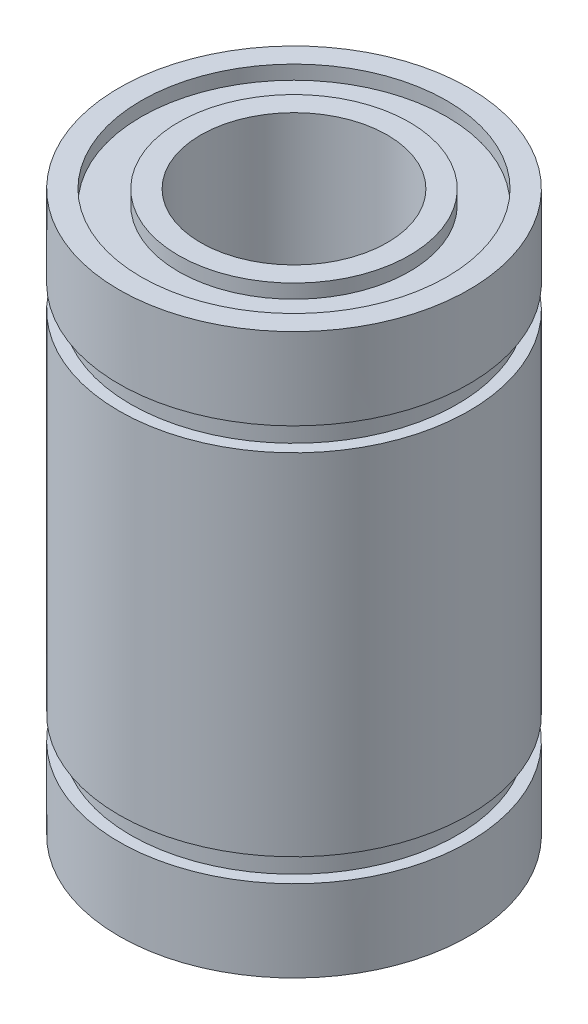
ISO-10303-21;
HEADER;
FILE_DESCRIPTION(('STEP AP214'),'2;1');
FILE_NAME('part.step','',(''),(''),'','','');
FILE_SCHEMA(('AUTOMOTIVE_DESIGN { 1 0 10303 214 1 1 1 1 }'));
ENDSEC;
DATA;
#1=APPLICATION_CONTEXT('core data for automotive mechanical design processes');
#2=APPLICATION_PROTOCOL_DEFINITION('international standard','automotive_design',2000,#1);
#3=PRODUCT_CONTEXT('',#1,'mechanical');
#4=PRODUCT('Part','Part','',(#3));
#5=PRODUCT_RELATED_PRODUCT_CATEGORY('part','',(#4));
#6=PRODUCT_DEFINITION_FORMATION('','',#4);
#7=PRODUCT_DEFINITION_CONTEXT('part definition',#1,'design');
#8=PRODUCT_DEFINITION('design','',#6,#7);
#9=PRODUCT_DEFINITION_SHAPE('','',#8);
#10=(LENGTH_UNIT() NAMED_UNIT(*) SI_UNIT(.MILLI.,.METRE.));
#11=(NAMED_UNIT(*) PLANE_ANGLE_UNIT() SI_UNIT($,.RADIAN.));
#12=(NAMED_UNIT(*) SI_UNIT($,.STERADIAN.) SOLID_ANGLE_UNIT());
#13=UNCERTAINTY_MEASURE_WITH_UNIT(LENGTH_MEASURE(1.E-05),#10,'distance_accuracy_value','');
#14=(GEOMETRIC_REPRESENTATION_CONTEXT(3) GLOBAL_UNCERTAINTY_ASSIGNED_CONTEXT((#13)) GLOBAL_UNIT_ASSIGNED_CONTEXT((#10,
#11,#12)) REPRESENTATION_CONTEXT('',''));
#15=CARTESIAN_POINT('',(0.,0.,0.));
#16=DIRECTION('',(0.,0.,1.));
#17=DIRECTION('',(1.,0.,0.));
#18=AXIS2_PLACEMENT_3D('',#15,#16,#17);
#19=CARTESIAN_POINT('',(0.,0.,0.));
#20=DIRECTION('',(0.,1.,0.));
#21=DIRECTION('',(0.,0.,1.));
#22=AXIS2_PLACEMENT_3D('',#19,#20,#21);
#23=PLANE('',#22);
#24=CARTESIAN_POINT('',(0.,0.,0.));
#25=DIRECTION('',(0.,1.,0.));
#26=DIRECTION('',(0.,0.,1.));
#27=AXIS2_PLACEMENT_3D('',#24,#25,#26);
#28=CIRCLE('',#27,4.);
#29=CARTESIAN_POINT('',(0.,0.,4.));
#30=VERTEX_POINT('',#29);
#31=EDGE_CURVE('E40',#30,#30,#28,.T.);
#32=ORIENTED_EDGE('',*,*,#31,.T.);
#33=EDGE_LOOP('',(#32));
#34=FACE_BOUND('',#33,.T.);
#35=CARTESIAN_POINT('',(0.,0.,0.));
#36=DIRECTION('',(0.,1.,0.));
#37=DIRECTION('',(0.,0.,1.));
#38=AXIS2_PLACEMENT_3D('',#35,#36,#37);
#39=CIRCLE('',#38,4.95);
#40=CARTESIAN_POINT('',(0.,0.,4.95));
#41=VERTEX_POINT('',#40);
#42=EDGE_CURVE('E36',#41,#41,#39,.T.);
#43=ORIENTED_EDGE('',*,*,#42,.F.);
#44=EDGE_LOOP('',(#43));
#45=FACE_BOUND('',#44,.T.);
#46=ADVANCED_FACE('F32',(#34,#45),#23,.F.);
#47=CARTESIAN_POINT('',(0.,0.,0.));
#48=DIRECTION('',(0.,1.,0.));
#49=DIRECTION('',(0.,0.,1.));
#50=AXIS2_PLACEMENT_3D('',#47,#48,#49);
#51=CIRCLE('',#50,7.5);
#52=CARTESIAN_POINT('',(0.,0.,7.5));
#53=VERTEX_POINT('',#52);
#54=EDGE_CURVE('E10',#53,#53,#51,.T.);
#55=ORIENTED_EDGE('',*,*,#54,.F.);
#56=EDGE_LOOP('',(#55));
#57=FACE_BOUND('',#56,.T.);
#58=CARTESIAN_POINT('',(0.,0.,0.));
#59=DIRECTION('',(0.,1.,0.));
#60=DIRECTION('',(0.,0.,1.));
#61=AXIS2_PLACEMENT_3D('',#58,#59,#60);
#62=CIRCLE('',#61,6.55);
#63=CARTESIAN_POINT('',(0.,0.,6.55));
#64=VERTEX_POINT('',#63);
#65=EDGE_CURVE('E54',#64,#64,#62,.F.);
#66=ORIENTED_EDGE('',*,*,#65,.F.);
#67=EDGE_LOOP('',(#66));
#68=FACE_BOUND('',#67,.T.);
#69=ADVANCED_FACE('F100',(#57,#68),#23,.F.);
#70=CARTESIAN_POINT('',(0.,12.,0.));
#71=DIRECTION('',(0.,-1.,0.));
#72=DIRECTION('',(0.,0.,-1.));
#73=AXIS2_PLACEMENT_3D('',#70,#71,#72);
#74=CYLINDRICAL_SURFACE('',#73,7.5);
#75=CARTESIAN_POINT('',(0.,4.5,0.));
#76=DIRECTION('',(0.,1.,0.));
#77=DIRECTION('',(0.,0.,1.));
#78=AXIS2_PLACEMENT_3D('',#75,#76,#77);
#79=CIRCLE('',#78,7.5);
#80=CARTESIAN_POINT('',(0.,4.5,7.5));
#81=VERTEX_POINT('',#80);
#82=EDGE_CURVE('E45',#81,#81,#79,.T.);
#83=ORIENTED_EDGE('',*,*,#82,.T.);
#84=EDGE_LOOP('',(#83));
#85=FACE_BOUND('',#84,.T.);
#86=CARTESIAN_POINT('',(0.,19.5,0.));
#87=DIRECTION('',(0.,1.,0.));
#88=DIRECTION('',(0.,0.,1.));
#89=AXIS2_PLACEMENT_3D('',#86,#87,#88);
#90=CIRCLE('',#89,7.5);
#91=CARTESIAN_POINT('',(0.,19.5,7.5));
#92=VERTEX_POINT('',#91);
#93=EDGE_CURVE('E172',#92,#92,#90,.T.);
#94=ORIENTED_EDGE('',*,*,#93,.F.);
#95=EDGE_LOOP('',(#94));
#96=FACE_BOUND('',#95,.T.);
#97=ADVANCED_FACE('F93',(#85,#96),#74,.T.);
#98=CARTESIAN_POINT('',(0.,3.5,0.));
#99=DIRECTION('',(0.,-1.,0.));
#100=DIRECTION('',(0.,0.,-1.));
#101=AXIS2_PLACEMENT_3D('',#98,#99,#100);
#102=CIRCLE('',#101,7.5);
#103=CARTESIAN_POINT('',(0.,3.5,-7.5));
#104=VERTEX_POINT('',#103);
#105=EDGE_CURVE('E49',#104,#104,#102,.T.);
#106=ORIENTED_EDGE('',*,*,#105,.T.);
#107=EDGE_LOOP('',(#106));
#108=FACE_BOUND('',#107,.T.);
#109=ORIENTED_EDGE('',*,*,#54,.T.);
#110=EDGE_LOOP('',(#109));
#111=FACE_BOUND('',#110,.T.);
#112=ADVANCED_FACE('F34',(#108,#111),#74,.T.);
#113=CARTESIAN_POINT('',(0.,12.,0.));
#114=DIRECTION('',(0.,-1.,0.));
#115=DIRECTION('',(0.,0.,-1.));
#116=AXIS2_PLACEMENT_3D('',#113,#114,#115);
#117=CYLINDRICAL_SURFACE('',#116,4.);
#118=ORIENTED_EDGE('',*,*,#31,.F.);
#119=EDGE_LOOP('',(#118));
#120=FACE_BOUND('',#119,.T.);
#121=CARTESIAN_POINT('',(0.,24.,0.));
#122=DIRECTION('',(0.,1.,0.));
#123=DIRECTION('',(0.,0.,1.));
#124=AXIS2_PLACEMENT_3D('',#121,#122,#123);
#125=CIRCLE('',#124,4.);
#126=CARTESIAN_POINT('',(0.,24.,4.));
#127=VERTEX_POINT('',#126);
#128=EDGE_CURVE('E175',#127,#127,#125,.T.);
#129=ORIENTED_EDGE('',*,*,#128,.T.);
#130=EDGE_LOOP('',(#129));
#131=FACE_BOUND('',#130,.T.);
#132=ADVANCED_FACE('F92',(#120,#131),#117,.F.);
#133=CARTESIAN_POINT('',(-8.,4.5,0.));
#134=DIRECTION('',(0.,1.,0.));
#135=DIRECTION('',(0.,0.,1.));
#136=AXIS2_PLACEMENT_3D('',#133,#134,#135);
#137=PLANE('',#136);
#138=CARTESIAN_POINT('',(0.,4.5,0.));
#139=DIRECTION('',(0.,1.,0.));
#140=DIRECTION('',(0.,0.,1.));
#141=AXIS2_PLACEMENT_3D('',#138,#139,#140);
#142=CIRCLE('',#141,7.);
#143=CARTESIAN_POINT('',(0.,4.5,7.));
#144=VERTEX_POINT('',#143);
#145=EDGE_CURVE('E52',#144,#144,#142,.T.);
#146=ORIENTED_EDGE('',*,*,#145,.T.);
#147=EDGE_LOOP('',(#146));
#148=FACE_BOUND('',#147,.T.);
#149=ORIENTED_EDGE('',*,*,#82,.F.);
#150=EDGE_LOOP('',(#149));
#151=FACE_BOUND('',#150,.T.);
#152=ADVANCED_FACE('F75',(#148,#151),#137,.F.);
#153=CARTESIAN_POINT('',(-8.,3.5,0.));
#154=DIRECTION('',(0.,-1.,0.));
#155=DIRECTION('',(0.,0.,-1.));
#156=AXIS2_PLACEMENT_3D('',#153,#154,#155);
#157=PLANE('',#156);
#158=CARTESIAN_POINT('',(0.,3.5,0.));
#159=DIRECTION('',(0.,1.,0.));
#160=DIRECTION('',(0.,0.,1.));
#161=AXIS2_PLACEMENT_3D('',#158,#159,#160);
#162=CIRCLE('',#161,7.);
#163=CARTESIAN_POINT('',(0.,3.5,7.));
#164=VERTEX_POINT('',#163);
#165=EDGE_CURVE('E60',#164,#164,#162,.T.);
#166=ORIENTED_EDGE('',*,*,#165,.F.);
#167=EDGE_LOOP('',(#166));
#168=FACE_BOUND('',#167,.T.);
#169=ORIENTED_EDGE('',*,*,#105,.F.);
#170=EDGE_LOOP('',(#169));
#171=FACE_BOUND('',#170,.T.);
#172=ADVANCED_FACE('F82',(#168,#171),#157,.F.);
#173=CARTESIAN_POINT('',(0.,4.,0.));
#174=DIRECTION('',(0.,1.,0.));
#175=DIRECTION('',(0.,0.,1.));
#176=AXIS2_PLACEMENT_3D('',#173,#174,#175);
#177=CYLINDRICAL_SURFACE('',#176,7.);
#178=ORIENTED_EDGE('',*,*,#145,.F.);
#179=EDGE_LOOP('',(#178));
#180=FACE_BOUND('',#179,.T.);
#181=ORIENTED_EDGE('',*,*,#165,.T.);
#182=EDGE_LOOP('',(#181));
#183=FACE_BOUND('',#182,.T.);
#184=ADVANCED_FACE('F78',(#180,#183),#177,.T.);
#185=CARTESIAN_POINT('',(0.,0.,0.));
#186=DIRECTION('',(0.,1.,0.));
#187=DIRECTION('',(0.,0.,1.));
#188=AXIS2_PLACEMENT_3D('',#185,#186,#187);
#189=CYLINDRICAL_SURFACE('',#188,4.95);
#190=CARTESIAN_POINT('',(0.,0.599999999999999,0.));
#191=DIRECTION('',(0.,1.,0.));
#192=DIRECTION('',(0.,0.,1.));
#193=AXIS2_PLACEMENT_3D('',#190,#191,#192);
#194=CIRCLE('',#193,4.95);
#195=CARTESIAN_POINT('',(0.,0.599999999999999,4.95));
#196=VERTEX_POINT('',#195);
#197=EDGE_CURVE('E56',#196,#196,#194,.T.);
#198=ORIENTED_EDGE('',*,*,#197,.F.);
#199=EDGE_LOOP('',(#198));
#200=FACE_BOUND('',#199,.T.);
#201=ORIENTED_EDGE('',*,*,#42,.T.);
#202=EDGE_LOOP('',(#201));
#203=FACE_BOUND('',#202,.T.);
#204=ADVANCED_FACE('F81',(#200,#203),#189,.T.);
#205=CARTESIAN_POINT('',(0.,0.,0.));
#206=DIRECTION('',(0.,1.,0.));
#207=DIRECTION('',(0.,0.,1.));
#208=AXIS2_PLACEMENT_3D('',#205,#206,#207);
#209=CYLINDRICAL_SURFACE('',#208,6.55);
#210=CARTESIAN_POINT('',(0.,0.6,0.));
#211=DIRECTION('',(0.,1.,0.));
#212=DIRECTION('',(0.,0.,1.));
#213=AXIS2_PLACEMENT_3D('',#210,#211,#212);
#214=CIRCLE('',#213,6.55);
#215=CARTESIAN_POINT('',(0.,0.6,6.55));
#216=VERTEX_POINT('',#215);
#217=EDGE_CURVE('E62',#216,#216,#214,.T.);
#218=ORIENTED_EDGE('',*,*,#217,.T.);
#219=EDGE_LOOP('',(#218));
#220=FACE_BOUND('',#219,.T.);
#221=ORIENTED_EDGE('',*,*,#65,.T.);
#222=EDGE_LOOP('',(#221));
#223=FACE_BOUND('',#222,.T.);
#224=ADVANCED_FACE('F114',(#220,#223),#209,.F.);
#225=CARTESIAN_POINT('',(0.,0.599999999999999,-6.55));
#226=DIRECTION('',(0.,-1.,0.));
#227=DIRECTION('',(0.,0.,-1.));
#228=AXIS2_PLACEMENT_3D('',#225,#226,#227);
#229=PLANE('',#228);
#230=ORIENTED_EDGE('',*,*,#197,.T.);
#231=EDGE_LOOP('',(#230));
#232=FACE_BOUND('',#231,.T.);
#233=ORIENTED_EDGE('',*,*,#217,.F.);
#234=EDGE_LOOP('',(#233));
#235=FACE_BOUND('',#234,.T.);
#236=ADVANCED_FACE('F116',(#232,#235),#229,.T.);
#237=CARTESIAN_POINT('',(0.,24.,0.));
#238=DIRECTION('',(0.,-1.,0.));
#239=DIRECTION('',(0.,0.,1.));
#240=AXIS2_PLACEMENT_3D('',#237,#238,#239);
#241=PLANE('',#240);
#242=ORIENTED_EDGE('',*,*,#128,.F.);
#243=EDGE_LOOP('',(#242));
#244=FACE_BOUND('',#243,.T.);
#245=CARTESIAN_POINT('',(0.,24.,0.));
#246=DIRECTION('',(0.,1.,0.));
#247=DIRECTION('',(0.,0.,1.));
#248=AXIS2_PLACEMENT_3D('',#245,#246,#247);
#249=CIRCLE('',#248,4.95);
#250=CARTESIAN_POINT('',(0.,24.,4.95));
#251=VERTEX_POINT('',#250);
#252=EDGE_CURVE('E164',#251,#251,#249,.T.);
#253=ORIENTED_EDGE('',*,*,#252,.T.);
#254=EDGE_LOOP('',(#253));
#255=FACE_BOUND('',#254,.T.);
#256=ADVANCED_FACE('F119',(#244,#255),#241,.F.);
#257=CARTESIAN_POINT('',(0.,24.,0.));
#258=DIRECTION('',(0.,1.,0.));
#259=DIRECTION('',(0.,0.,1.));
#260=AXIS2_PLACEMENT_3D('',#257,#258,#259);
#261=CIRCLE('',#260,7.5);
#262=CARTESIAN_POINT('',(0.,24.,7.5));
#263=VERTEX_POINT('',#262);
#264=EDGE_CURVE('E67',#263,#263,#261,.T.);
#265=ORIENTED_EDGE('',*,*,#264,.T.);
#266=EDGE_LOOP('',(#265));
#267=FACE_BOUND('',#266,.T.);
#268=CARTESIAN_POINT('',(0.,24.,0.));
#269=DIRECTION('',(0.,1.,0.));
#270=DIRECTION('',(0.,0.,1.));
#271=AXIS2_PLACEMENT_3D('',#268,#269,#270);
#272=CIRCLE('',#271,6.55);
#273=CARTESIAN_POINT('',(0.,24.,6.55));
#274=VERTEX_POINT('',#273);
#275=EDGE_CURVE('E162',#274,#274,#272,.F.);
#276=ORIENTED_EDGE('',*,*,#275,.T.);
#277=EDGE_LOOP('',(#276));
#278=FACE_BOUND('',#277,.T.);
#279=ADVANCED_FACE('F127',(#267,#278),#241,.F.);
#280=CARTESIAN_POINT('',(0.,12.,0.));
#281=DIRECTION('',(0.,1.,0.));
#282=DIRECTION('',(0.,0.,-1.));
#283=AXIS2_PLACEMENT_3D('',#280,#281,#282);
#284=CYLINDRICAL_SURFACE('',#283,7.5);
#285=CARTESIAN_POINT('',(0.,20.5,0.));
#286=DIRECTION('',(0.,-1.,0.));
#287=DIRECTION('',(0.,0.,-1.));
#288=AXIS2_PLACEMENT_3D('',#285,#286,#287);
#289=CIRCLE('',#288,7.5);
#290=CARTESIAN_POINT('',(0.,20.5,-7.5));
#291=VERTEX_POINT('',#290);
#292=EDGE_CURVE('E176',#291,#291,#289,.T.);
#293=ORIENTED_EDGE('',*,*,#292,.F.);
#294=EDGE_LOOP('',(#293));
#295=FACE_BOUND('',#294,.T.);
#296=ORIENTED_EDGE('',*,*,#264,.F.);
#297=EDGE_LOOP('',(#296));
#298=FACE_BOUND('',#297,.T.);
#299=ADVANCED_FACE('F123',(#295,#298),#284,.T.);
#300=CARTESIAN_POINT('',(-8.,19.5,0.));
#301=DIRECTION('',(0.,-1.,0.));
#302=DIRECTION('',(0.,0.,1.));
#303=AXIS2_PLACEMENT_3D('',#300,#301,#302);
#304=PLANE('',#303);
#305=CARTESIAN_POINT('',(0.,19.5,0.));
#306=DIRECTION('',(0.,1.,0.));
#307=DIRECTION('',(0.,0.,1.));
#308=AXIS2_PLACEMENT_3D('',#305,#306,#307);
#309=CIRCLE('',#308,7.);
#310=CARTESIAN_POINT('',(0.,19.5,7.));
#311=VERTEX_POINT('',#310);
#312=EDGE_CURVE('E179',#311,#311,#309,.T.);
#313=ORIENTED_EDGE('',*,*,#312,.F.);
#314=EDGE_LOOP('',(#313));
#315=FACE_BOUND('',#314,.T.);
#316=ORIENTED_EDGE('',*,*,#93,.T.);
#317=EDGE_LOOP('',(#316));
#318=FACE_BOUND('',#317,.T.);
#319=ADVANCED_FACE('F126',(#315,#318),#304,.F.);
#320=CARTESIAN_POINT('',(-8.,20.5,0.));
#321=DIRECTION('',(0.,1.,0.));
#322=DIRECTION('',(0.,0.,-1.));
#323=AXIS2_PLACEMENT_3D('',#320,#321,#322);
#324=PLANE('',#323);
#325=CARTESIAN_POINT('',(0.,20.5,0.));
#326=DIRECTION('',(0.,1.,0.));
#327=DIRECTION('',(0.,0.,1.));
#328=AXIS2_PLACEMENT_3D('',#325,#326,#327);
#329=CIRCLE('',#328,7.);
#330=CARTESIAN_POINT('',(0.,20.5,7.));
#331=VERTEX_POINT('',#330);
#332=EDGE_CURVE('E168',#331,#331,#329,.T.);
#333=ORIENTED_EDGE('',*,*,#332,.T.);
#334=EDGE_LOOP('',(#333));
#335=FACE_BOUND('',#334,.T.);
#336=ORIENTED_EDGE('',*,*,#292,.T.);
#337=EDGE_LOOP('',(#336));
#338=FACE_BOUND('',#337,.T.);
#339=ADVANCED_FACE('F136',(#335,#338),#324,.F.);
#340=CARTESIAN_POINT('',(0.,20.,0.));
#341=DIRECTION('',(0.,-1.,0.));
#342=DIRECTION('',(0.,0.,1.));
#343=AXIS2_PLACEMENT_3D('',#340,#341,#342);
#344=CYLINDRICAL_SURFACE('',#343,7.);
#345=ORIENTED_EDGE('',*,*,#312,.T.);
#346=EDGE_LOOP('',(#345));
#347=FACE_BOUND('',#346,.T.);
#348=ORIENTED_EDGE('',*,*,#332,.F.);
#349=EDGE_LOOP('',(#348));
#350=FACE_BOUND('',#349,.T.);
#351=ADVANCED_FACE('F132',(#347,#350),#344,.T.);
#352=CARTESIAN_POINT('',(0.,24.,0.));
#353=DIRECTION('',(0.,-1.,0.));
#354=DIRECTION('',(0.,0.,1.));
#355=AXIS2_PLACEMENT_3D('',#352,#353,#354);
#356=CYLINDRICAL_SURFACE('',#355,4.95);
#357=CARTESIAN_POINT('',(0.,23.4,0.));
#358=DIRECTION('',(0.,1.,0.));
#359=DIRECTION('',(0.,0.,1.));
#360=AXIS2_PLACEMENT_3D('',#357,#358,#359);
#361=CIRCLE('',#360,4.95);
#362=CARTESIAN_POINT('',(0.,23.4,4.95));
#363=VERTEX_POINT('',#362);
#364=EDGE_CURVE('E165',#363,#363,#361,.T.);
#365=ORIENTED_EDGE('',*,*,#364,.T.);
#366=EDGE_LOOP('',(#365));
#367=FACE_BOUND('',#366,.T.);
#368=ORIENTED_EDGE('',*,*,#252,.F.);
#369=EDGE_LOOP('',(#368));
#370=FACE_BOUND('',#369,.T.);
#371=ADVANCED_FACE('F135',(#367,#370),#356,.T.);
#372=CARTESIAN_POINT('',(0.,24.,0.));
#373=DIRECTION('',(0.,-1.,0.));
#374=DIRECTION('',(0.,0.,1.));
#375=AXIS2_PLACEMENT_3D('',#372,#373,#374);
#376=CYLINDRICAL_SURFACE('',#375,6.55);
#377=CARTESIAN_POINT('',(0.,23.4,0.));
#378=DIRECTION('',(0.,1.,0.));
#379=DIRECTION('',(0.,0.,1.));
#380=AXIS2_PLACEMENT_3D('',#377,#378,#379);
#381=CIRCLE('',#380,6.55);
#382=CARTESIAN_POINT('',(0.,23.4,6.55));
#383=VERTEX_POINT('',#382);
#384=EDGE_CURVE('E159',#383,#383,#381,.T.);
#385=ORIENTED_EDGE('',*,*,#384,.F.);
#386=EDGE_LOOP('',(#385));
#387=FACE_BOUND('',#386,.T.);
#388=ORIENTED_EDGE('',*,*,#275,.F.);
#389=EDGE_LOOP('',(#388));
#390=FACE_BOUND('',#389,.T.);
#391=ADVANCED_FACE('F146',(#387,#390),#376,.F.);
#392=CARTESIAN_POINT('',(0.,23.4,-6.55));
#393=DIRECTION('',(0.,1.,0.));
#394=DIRECTION('',(0.,0.,-1.));
#395=AXIS2_PLACEMENT_3D('',#392,#393,#394);
#396=PLANE('',#395);
#397=ORIENTED_EDGE('',*,*,#364,.F.);
#398=EDGE_LOOP('',(#397));
#399=FACE_BOUND('',#398,.T.);
#400=ORIENTED_EDGE('',*,*,#384,.T.);
#401=EDGE_LOOP('',(#400));
#402=FACE_BOUND('',#401,.T.);
#403=ADVANCED_FACE('F148',(#399,#402),#396,.T.);
#404=CLOSED_SHELL('',(#46,#69,#97,#112,#132,#152,#172,#184,#204,#224,#236,#256,#279,#299,#319,
#339,#351,#371,#391,#403));
#405=MANIFOLD_SOLID_BREP('B2',#404);
#406=ADVANCED_BREP_SHAPE_REPRESENTATION('',(#18,#405),#14);
#407=SHAPE_DEFINITION_REPRESENTATION(#9,#406);
ENDSEC;
END-ISO-10303-21;
